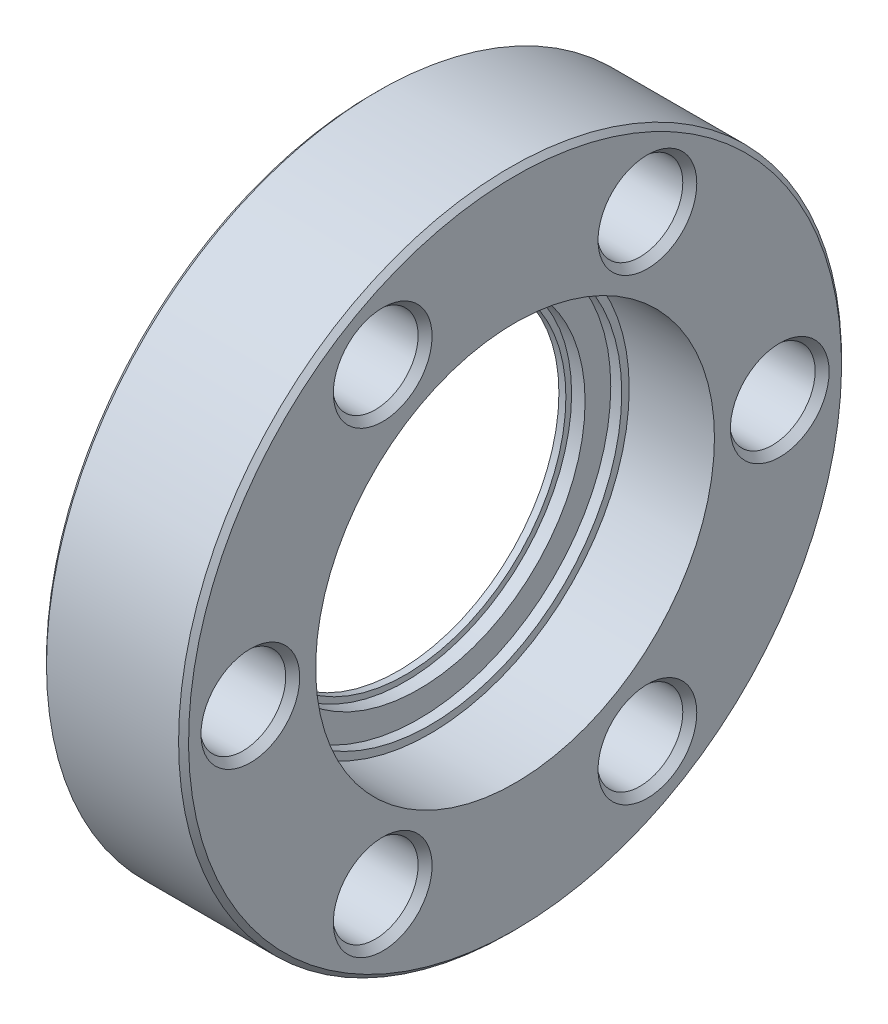
ISO-10303-21;
HEADER;
FILE_DESCRIPTION(('STEP AP214'),'2;1');
FILE_NAME('part.step','',(''),(''),'','','');
FILE_SCHEMA(('AUTOMOTIVE_DESIGN { 1 0 10303 214 1 1 1 1 }'));
ENDSEC;
DATA;
#1=APPLICATION_CONTEXT('core data for automotive mechanical design processes');
#2=APPLICATION_PROTOCOL_DEFINITION('international standard','automotive_design',2000,#1);
#3=PRODUCT_CONTEXT('',#1,'mechanical');
#4=PRODUCT('Part','Part','',(#3));
#5=PRODUCT_RELATED_PRODUCT_CATEGORY('part','',(#4));
#6=PRODUCT_DEFINITION_FORMATION('','',#4);
#7=PRODUCT_DEFINITION_CONTEXT('part definition',#1,'design');
#8=PRODUCT_DEFINITION('design','',#6,#7);
#9=PRODUCT_DEFINITION_SHAPE('','',#8);
#10=(LENGTH_UNIT() NAMED_UNIT(*) SI_UNIT(.MILLI.,.METRE.));
#11=(NAMED_UNIT(*) PLANE_ANGLE_UNIT() SI_UNIT($,.RADIAN.));
#12=(NAMED_UNIT(*) SI_UNIT($,.STERADIAN.) SOLID_ANGLE_UNIT());
#13=UNCERTAINTY_MEASURE_WITH_UNIT(LENGTH_MEASURE(1.E-05),#10,'distance_accuracy_value','');
#14=(GEOMETRIC_REPRESENTATION_CONTEXT(3) GLOBAL_UNCERTAINTY_ASSIGNED_CONTEXT((#13)) GLOBAL_UNIT_ASSIGNED_CONTEXT((#10,
#11,#12)) REPRESENTATION_CONTEXT('',''));
#15=CARTESIAN_POINT('',(0.,0.,0.));
#16=DIRECTION('',(0.,0.,1.));
#17=DIRECTION('',(1.,0.,0.));
#18=AXIS2_PLACEMENT_3D('',#15,#16,#17);
#19=CARTESIAN_POINT('',(1.2954,0.,0.));
#20=DIRECTION('',(1.,0.,0.));
#21=DIRECTION('',(0.,0.,-1.));
#22=AXIS2_PLACEMENT_3D('',#19,#20,#21);
#23=PLANE('',#22);
#24=CARTESIAN_POINT('',(1.2954,0.,0.));
#25=DIRECTION('',(-1.,0.,0.));
#26=DIRECTION('',(0.,0.,1.));
#27=AXIS2_PLACEMENT_3D('',#24,#25,#26);
#28=CIRCLE('',#27,9.144);
#29=CARTESIAN_POINT('',(1.2954,0.,9.144));
#30=VERTEX_POINT('',#29);
#31=EDGE_CURVE('E95',#30,#30,#28,.T.);
#32=ORIENTED_EDGE('',*,*,#31,.T.);
#33=EDGE_LOOP('',(#32));
#34=FACE_BOUND('',#33,.T.);
#35=CARTESIAN_POINT('',(1.2954,0.,0.));
#36=DIRECTION('',(1.,0.,0.));
#37=DIRECTION('',(0.,0.,-1.));
#38=AXIS2_PLACEMENT_3D('',#35,#36,#37);
#39=CIRCLE('',#38,8.1788);
#40=CARTESIAN_POINT('',(1.2954,0.,-8.1788));
#41=VERTEX_POINT('',#40);
#42=EDGE_CURVE('E17',#41,#41,#39,.T.);
#43=ORIENTED_EDGE('',*,*,#42,.T.);
#44=EDGE_LOOP('',(#43));
#45=FACE_BOUND('',#44,.T.);
#46=ADVANCED_FACE('F14',(#34,#45),#23,.F.);
#47=CARTESIAN_POINT('',(0.,0.,0.));
#48=DIRECTION('',(1.,0.,0.));
#49=DIRECTION('',(0.,0.,-1.));
#50=AXIS2_PLACEMENT_3D('',#47,#48,#49);
#51=CYLINDRICAL_SURFACE('',#50,8.1788);
#52=ORIENTED_EDGE('',*,*,#42,.F.);
#53=EDGE_LOOP('',(#52));
#54=FACE_BOUND('',#53,.T.);
#55=CARTESIAN_POINT('',(1.651,0.,0.));
#56=DIRECTION('',(1.,0.,0.));
#57=DIRECTION('',(0.,0.,-1.));
#58=AXIS2_PLACEMENT_3D('',#55,#56,#57);
#59=CIRCLE('',#58,8.1788);
#60=CARTESIAN_POINT('',(1.651,0.,-8.1788));
#61=VERTEX_POINT('',#60);
#62=EDGE_CURVE('E93',#61,#61,#59,.F.);
#63=ORIENTED_EDGE('',*,*,#62,.F.);
#64=EDGE_LOOP('',(#63));
#65=FACE_BOUND('',#64,.T.);
#66=ADVANCED_FACE('F103',(#54,#65),#51,.F.);
#67=CARTESIAN_POINT('',(1.2954,0.,0.));
#68=DIRECTION('',(-1.,0.,0.));
#69=DIRECTION('',(0.,0.,1.));
#70=AXIS2_PLACEMENT_3D('',#67,#68,#69);
#71=CYLINDRICAL_SURFACE('',#70,9.144);
#72=ORIENTED_EDGE('',*,*,#31,.F.);
#73=EDGE_LOOP('',(#72));
#74=FACE_BOUND('',#73,.T.);
#75=CARTESIAN_POINT('',(0.6604,0.,0.));
#76=DIRECTION('',(1.,0.,0.));
#77=DIRECTION('',(0.,0.,-1.));
#78=AXIS2_PLACEMENT_3D('',#75,#76,#77);
#79=CIRCLE('',#78,9.144);
#80=CARTESIAN_POINT('',(0.6604,0.,-9.144));
#81=VERTEX_POINT('',#80);
#82=EDGE_CURVE('E29',#81,#81,#79,.T.);
#83=ORIENTED_EDGE('',*,*,#82,.F.);
#84=EDGE_LOOP('',(#83));
#85=FACE_BOUND('',#84,.T.);
#86=ADVANCED_FACE('F106',(#74,#85),#71,.F.);
#87=CARTESIAN_POINT('',(1.651,0.,0.));
#88=DIRECTION('',(1.,0.,0.));
#89=DIRECTION('',(0.,0.,-1.));
#90=AXIS2_PLACEMENT_3D('',#87,#88,#89);
#91=PLANE('',#90);
#92=ORIENTED_EDGE('',*,*,#62,.T.);
#93=EDGE_LOOP('',(#92));
#94=FACE_BOUND('',#93,.T.);
#95=CARTESIAN_POINT('',(1.651,0.,0.));
#96=DIRECTION('',(1.,0.,0.));
#97=DIRECTION('',(0.,0.,-1.));
#98=AXIS2_PLACEMENT_3D('',#95,#96,#97);
#99=CIRCLE('',#98,8.4709);
#100=CARTESIAN_POINT('',(1.651,0.,-8.4709));
#101=VERTEX_POINT('',#100);
#102=EDGE_CURVE('E90',#101,#101,#99,.T.);
#103=ORIENTED_EDGE('',*,*,#102,.T.);
#104=EDGE_LOOP('',(#103));
#105=FACE_BOUND('',#104,.T.);
#106=ADVANCED_FACE('F109',(#94,#105),#91,.T.);
#107=CARTESIAN_POINT('',(1.2335803249224,0.,0.));
#108=DIRECTION('',(1.,0.,0.));
#109=DIRECTION('',(0.,0.,-1.));
#110=AXIS2_PLACEMENT_3D('',#107,#108,#109);
#111=CONICAL_SURFACE('',#110,10.7188,1.22173047639604);
#112=CARTESIAN_POINT('',(1.2335803249224,0.,0.));
#113=DIRECTION('',(1.,0.,0.));
#114=DIRECTION('',(0.,0.,-1.));
#115=AXIS2_PLACEMENT_3D('',#112,#113,#114);
#116=CIRCLE('',#115,10.7188);
#117=CARTESIAN_POINT('',(1.2335803249224,0.,-10.7188));
#118=VERTEX_POINT('',#117);
#119=EDGE_CURVE('E89',#118,#118,#116,.F.);
#120=ORIENTED_EDGE('',*,*,#119,.T.);
#121=EDGE_LOOP('',(#120));
#122=FACE_BOUND('',#121,.T.);
#123=ORIENTED_EDGE('',*,*,#82,.T.);
#124=EDGE_LOOP('',(#123));
#125=FACE_BOUND('',#124,.T.);
#126=ADVANCED_FACE('F112',(#122,#125),#111,.T.);
#127=CARTESIAN_POINT('',(1.651,0.,0.));
#128=DIRECTION('',(1.,0.,0.));
#129=DIRECTION('',(0.,0.,-1.));
#130=AXIS2_PLACEMENT_3D('',#127,#128,#129);
#131=CYLINDRICAL_SURFACE('',#130,8.4709);
#132=ORIENTED_EDGE('',*,*,#102,.F.);
#133=EDGE_LOOP('',(#132));
#134=FACE_BOUND('',#133,.T.);
#135=CARTESIAN_POINT('',(2.3368,0.,0.));
#136=DIRECTION('',(1.,0.,0.));
#137=DIRECTION('',(0.,0.,-1.));
#138=AXIS2_PLACEMENT_3D('',#135,#136,#137);
#139=CIRCLE('',#138,8.4709);
#140=CARTESIAN_POINT('',(2.3368,0.,-8.4709));
#141=VERTEX_POINT('',#140);
#142=EDGE_CURVE('E86',#141,#141,#139,.F.);
#143=ORIENTED_EDGE('',*,*,#142,.F.);
#144=EDGE_LOOP('',(#143));
#145=FACE_BOUND('',#144,.T.);
#146=ADVANCED_FACE('F116',(#134,#145),#131,.F.);
#147=CARTESIAN_POINT('',(7.239,0.,0.));
#148=DIRECTION('',(1.,0.,0.));
#149=DIRECTION('',(0.,0.,-1.));
#150=AXIS2_PLACEMENT_3D('',#147,#148,#149);
#151=CYLINDRICAL_SURFACE('',#150,10.7188);
#152=CARTESIAN_POINT('',(0.,0.,0.));
#153=DIRECTION('',(1.,0.,0.));
#154=DIRECTION('',(0.,0.,-1.));
#155=AXIS2_PLACEMENT_3D('',#152,#153,#154);
#156=CIRCLE('',#155,10.7188);
#157=CARTESIAN_POINT('',(0.,0.,-10.7188));
#158=VERTEX_POINT('',#157);
#159=EDGE_CURVE('E83',#158,#158,#156,.F.);
#160=ORIENTED_EDGE('',*,*,#159,.T.);
#161=EDGE_LOOP('',(#160));
#162=FACE_BOUND('',#161,.T.);
#163=ORIENTED_EDGE('',*,*,#119,.F.);
#164=EDGE_LOOP('',(#163));
#165=FACE_BOUND('',#164,.T.);
#166=ADVANCED_FACE('F119',(#162,#165),#151,.F.);
#167=CARTESIAN_POINT('',(2.3368,0.,0.));
#168=DIRECTION('',(1.,0.,0.));
#169=DIRECTION('',(0.,0.,-1.));
#170=AXIS2_PLACEMENT_3D('',#167,#168,#169);
#171=PLANE('',#170);
#172=ORIENTED_EDGE('',*,*,#142,.T.);
#173=EDGE_LOOP('',(#172));
#174=FACE_BOUND('',#173,.T.);
#175=CARTESIAN_POINT('',(2.3368,0.,0.));
#176=DIRECTION('',(1.,0.,0.));
#177=DIRECTION('',(0.,0.,-1.));
#178=AXIS2_PLACEMENT_3D('',#175,#176,#177);
#179=CIRCLE('',#178,9.779);
#180=CARTESIAN_POINT('',(2.3368,0.,-9.779));
#181=VERTEX_POINT('',#180);
#182=EDGE_CURVE('E80',#181,#181,#179,.T.);
#183=ORIENTED_EDGE('',*,*,#182,.T.);
#184=EDGE_LOOP('',(#183));
#185=FACE_BOUND('',#184,.T.);
#186=ADVANCED_FACE('F123',(#174,#185),#171,.T.);
#187=CARTESIAN_POINT('',(0.,0.,0.));
#188=DIRECTION('',(1.,0.,0.));
#189=DIRECTION('',(0.,0.,-1.));
#190=AXIS2_PLACEMENT_3D('',#187,#188,#189);
#191=PLANE('',#190);
#192=ORIENTED_EDGE('',*,*,#159,.F.);
#193=EDGE_LOOP('',(#192));
#194=FACE_BOUND('',#193,.T.);
#195=CARTESIAN_POINT('',(0.,0.,0.));
#196=DIRECTION('',(1.,0.,0.));
#197=DIRECTION('',(0.,0.,-1.));
#198=AXIS2_PLACEMENT_3D('',#195,#196,#197);
#199=CIRCLE('',#198,16.637);
#200=CARTESIAN_POINT('',(0.,0.,-16.637));
#201=VERTEX_POINT('',#200);
#202=EDGE_CURVE('E59',#201,#201,#199,.T.);
#203=ORIENTED_EDGE('',*,*,#202,.F.);
#204=EDGE_LOOP('',(#203));
#205=FACE_BOUND('',#204,.T.);
#206=CARTESIAN_POINT('',(0.,11.6804310310022,-6.74370000000002));
#207=DIRECTION('',(-1.,0.,0.));
#208=DIRECTION('',(0.,0.,1.));
#209=AXIS2_PLACEMENT_3D('',#206,#207,#208);
#210=CIRCLE('',#209,2.56540000002181);
#211=CARTESIAN_POINT('',(0.,11.6804310310022,-4.17829999997821));
#212=VERTEX_POINT('',#211);
#213=EDGE_CURVE('E62',#212,#212,#210,.F.);
#214=ORIENTED_EDGE('',*,*,#213,.T.);
#215=EDGE_LOOP('',(#214));
#216=FACE_BOUND('',#215,.T.);
#217=CARTESIAN_POINT('',(-5.6843418860808E-11,0.,-13.4874));
#218=DIRECTION('',(-1.,0.,0.));
#219=DIRECTION('',(0.,0.,1.));
#220=AXIS2_PLACEMENT_3D('',#217,#218,#219);
#221=CIRCLE('',#220,2.56540000004833);
#222=CARTESIAN_POINT('',(-5.6843418860808E-11,0.,-10.9219999999517));
#223=VERTEX_POINT('',#222);
#224=EDGE_CURVE('E65',#223,#223,#221,.F.);
#225=ORIENTED_EDGE('',*,*,#224,.T.);
#226=EDGE_LOOP('',(#225));
#227=FACE_BOUND('',#226,.T.);
#228=CARTESIAN_POINT('',(0.,-11.6804310310023,-6.74369999999993));
#229=DIRECTION('',(-1.,0.,0.));
#230=DIRECTION('',(0.,0.,1.));
#231=AXIS2_PLACEMENT_3D('',#228,#229,#230);
#232=CIRCLE('',#231,2.56539999996488);
#233=CARTESIAN_POINT('',(0.,-11.6804310310023,-4.17830000003505));
#234=VERTEX_POINT('',#233);
#235=EDGE_CURVE('E68',#234,#234,#232,.F.);
#236=ORIENTED_EDGE('',*,*,#235,.T.);
#237=EDGE_LOOP('',(#236));
#238=FACE_BOUND('',#237,.T.);
#239=CARTESIAN_POINT('',(0.,-11.6804310310022,6.7437000000001));
#240=DIRECTION('',(-1.,0.,0.));
#241=DIRECTION('',(0.,0.,1.));
#242=AXIS2_PLACEMENT_3D('',#239,#240,#241);
#243=CIRCLE('',#242,2.56539999999575);
#244=CARTESIAN_POINT('',(0.,-11.6804310310022,9.30909999999585));
#245=VERTEX_POINT('',#244);
#246=EDGE_CURVE('E71',#245,#245,#243,.F.);
#247=ORIENTED_EDGE('',*,*,#246,.T.);
#248=EDGE_LOOP('',(#247));
#249=FACE_BOUND('',#248,.T.);
#250=CARTESIAN_POINT('',(-5.6843418860808E-11,1.43982048506075E-13,13.4874));
#251=DIRECTION('',(-1.,0.,0.));
#252=DIRECTION('',(0.,0.,1.));
#253=AXIS2_PLACEMENT_3D('',#250,#251,#252);
#254=CIRCLE('',#253,2.5654000000113);
#255=CARTESIAN_POINT('',(-5.6843418860808E-11,1.43982048506075E-13,16.0528000000113));
#256=VERTEX_POINT('',#255);
#257=EDGE_CURVE('E74',#256,#256,#254,.F.);
#258=ORIENTED_EDGE('',*,*,#257,.T.);
#259=EDGE_LOOP('',(#258));
#260=FACE_BOUND('',#259,.T.);
#261=CARTESIAN_POINT('',(5.6843418860808E-11,11.6804310310023,6.74369999999985));
#262=DIRECTION('',(-1.,0.,0.));
#263=DIRECTION('',(0.,0.,1.));
#264=AXIS2_PLACEMENT_3D('',#261,#262,#263);
#265=CIRCLE('',#264,2.56540000009483);
#266=CARTESIAN_POINT('',(5.6843418860808E-11,11.6804310310023,9.30910000009468));
#267=VERTEX_POINT('',#266);
#268=EDGE_CURVE('E77',#267,#267,#265,.F.);
#269=ORIENTED_EDGE('',*,*,#268,.T.);
#270=EDGE_LOOP('',(#269));
#271=FACE_BOUND('',#270,.T.);
#272=ADVANCED_FACE('F126',(#194,#205,#216,#227,#238,#249,#260,#271),#191,.F.);
#273=CARTESIAN_POINT('',(2.3368,0.,0.));
#274=DIRECTION('',(1.,0.,0.));
#275=DIRECTION('',(0.,0.,-1.));
#276=AXIS2_PLACEMENT_3D('',#273,#274,#275);
#277=CYLINDRICAL_SURFACE('',#276,9.779);
#278=ORIENTED_EDGE('',*,*,#182,.F.);
#279=EDGE_LOOP('',(#278));
#280=FACE_BOUND('',#279,.T.);
#281=CARTESIAN_POINT('',(2.8956,0.,0.));
#282=DIRECTION('',(1.,0.,0.));
#283=DIRECTION('',(0.,0.,-1.));
#284=AXIS2_PLACEMENT_3D('',#281,#282,#283);
#285=CIRCLE('',#284,9.779);
#286=CARTESIAN_POINT('',(2.8956,0.,-9.779));
#287=VERTEX_POINT('',#286);
#288=EDGE_CURVE('E55',#287,#287,#285,.F.);
#289=ORIENTED_EDGE('',*,*,#288,.F.);
#290=EDGE_LOOP('',(#289));
#291=FACE_BOUND('',#290,.T.);
#292=ADVANCED_FACE('F130',(#280,#291),#277,.F.);
#293=CARTESIAN_POINT('',(1.70530256582424E-10,11.6804310310023,6.74369999999985));
#294=DIRECTION('',(-1.,0.,0.));
#295=DIRECTION('',(0.,0.,1.));
#296=AXIS2_PLACEMENT_3D('',#293,#294,#295);
#297=CONICAL_SURFACE('',#296,2.565399999996,0.715584993335024);
#298=CARTESIAN_POINT('',(0.438290363151198,11.6804310310023,6.74369999999985));
#299=DIRECTION('',(-1.,0.,0.));
#300=DIRECTION('',(0.,0.,1.));
#301=AXIS2_PLACEMENT_3D('',#298,#299,#300);
#302=CIRCLE('',#301,2.1844);
#303=CARTESIAN_POINT('',(0.438290363151198,11.6804310310023,8.92809999999985));
#304=VERTEX_POINT('',#303);
#305=EDGE_CURVE('E58',#304,#304,#302,.F.);
#306=ORIENTED_EDGE('',*,*,#305,.T.);
#307=EDGE_LOOP('',(#306));
#308=FACE_BOUND('',#307,.T.);
#309=ORIENTED_EDGE('',*,*,#268,.F.);
#310=EDGE_LOOP('',(#309));
#311=FACE_BOUND('',#310,.T.);
#312=ADVANCED_FACE('F133',(#308,#311),#297,.F.);
#313=CARTESIAN_POINT('',(-5.6843418860808E-11,1.43982048506075E-13,13.4874));
#314=DIRECTION('',(-1.,0.,0.));
#315=DIRECTION('',(0.,0.,1.));
#316=AXIS2_PLACEMENT_3D('',#313,#314,#315);
#317=CONICAL_SURFACE('',#316,2.5654000000113,0.715584993325368);
#318=CARTESIAN_POINT('',(0.438290363151205,1.43982048506075E-13,13.4874));
#319=DIRECTION('',(-1.,0.,0.));
#320=DIRECTION('',(0.,0.,1.));
#321=AXIS2_PLACEMENT_3D('',#318,#319,#320);
#322=CIRCLE('',#321,2.1844);
#323=CARTESIAN_POINT('',(0.438290363151205,1.43982048506075E-13,15.6718));
#324=VERTEX_POINT('',#323);
#325=EDGE_CURVE('E228',#324,#324,#322,.F.);
#326=ORIENTED_EDGE('',*,*,#325,.T.);
#327=EDGE_LOOP('',(#326));
#328=FACE_BOUND('',#327,.T.);
#329=ORIENTED_EDGE('',*,*,#257,.F.);
#330=EDGE_LOOP('',(#329));
#331=FACE_BOUND('',#330,.T.);
#332=ADVANCED_FACE('F306',(#328,#331),#317,.F.);
#333=CARTESIAN_POINT('',(0.,-11.6804310310022,6.7437000000001));
#334=DIRECTION('',(-1.,0.,0.));
#335=DIRECTION('',(0.,0.,1.));
#336=AXIS2_PLACEMENT_3D('',#333,#334,#335);
#337=CONICAL_SURFACE('',#336,2.56539999999575,0.715584993335024);
#338=CARTESIAN_POINT('',(0.438290363151198,-11.6804310310022,6.7437000000001));
#339=DIRECTION('',(-1.,0.,0.));
#340=DIRECTION('',(0.,0.,1.));
#341=AXIS2_PLACEMENT_3D('',#338,#339,#340);
#342=CIRCLE('',#341,2.1844);
#343=CARTESIAN_POINT('',(0.438290363151198,-11.6804310310022,8.9281000000001));
#344=VERTEX_POINT('',#343);
#345=EDGE_CURVE('E225',#344,#344,#342,.F.);
#346=ORIENTED_EDGE('',*,*,#345,.T.);
#347=EDGE_LOOP('',(#346));
#348=FACE_BOUND('',#347,.T.);
#349=ORIENTED_EDGE('',*,*,#246,.F.);
#350=EDGE_LOOP('',(#349));
#351=FACE_BOUND('',#350,.T.);
#352=ADVANCED_FACE('F316',(#348,#351),#337,.F.);
#353=CARTESIAN_POINT('',(0.,-11.6804310310023,-6.74369999999993));
#354=DIRECTION('',(-1.,0.,0.));
#355=DIRECTION('',(0.,0.,1.));
#356=AXIS2_PLACEMENT_3D('',#353,#354,#355);
#357=CONICAL_SURFACE('',#356,2.56539999996488,0.715584993325368);
#358=CARTESIAN_POINT('',(0.438290363151204,-11.6804310310023,-6.74369999999993));
#359=DIRECTION('',(-1.,0.,0.));
#360=DIRECTION('',(0.,0.,1.));
#361=AXIS2_PLACEMENT_3D('',#358,#359,#360);
#362=CIRCLE('',#361,2.1844);
#363=CARTESIAN_POINT('',(0.438290363151204,-11.6804310310023,-4.55929999999993));
#364=VERTEX_POINT('',#363);
#365=EDGE_CURVE('E222',#364,#364,#362,.F.);
#366=ORIENTED_EDGE('',*,*,#365,.T.);
#367=EDGE_LOOP('',(#366));
#368=FACE_BOUND('',#367,.T.);
#369=ORIENTED_EDGE('',*,*,#235,.F.);
#370=EDGE_LOOP('',(#369));
#371=FACE_BOUND('',#370,.T.);
#372=ADVANCED_FACE('F326',(#368,#371),#357,.F.);
#373=CARTESIAN_POINT('',(5.6843418860808E-11,0.,-13.4874));
#374=DIRECTION('',(-1.,0.,0.));
#375=DIRECTION('',(0.,0.,1.));
#376=AXIS2_PLACEMENT_3D('',#373,#374,#375);
#377=CONICAL_SURFACE('',#376,2.5653999999495,0.715584993335024);
#378=CARTESIAN_POINT('',(0.438290363151191,0.,-13.4874));
#379=DIRECTION('',(-1.,0.,0.));
#380=DIRECTION('',(0.,0.,1.));
#381=AXIS2_PLACEMENT_3D('',#378,#379,#380);
#382=CIRCLE('',#381,2.1844);
#383=CARTESIAN_POINT('',(0.438290363151191,0.,-11.303));
#384=VERTEX_POINT('',#383);
#385=EDGE_CURVE('E219',#384,#384,#382,.F.);
#386=ORIENTED_EDGE('',*,*,#385,.T.);
#387=EDGE_LOOP('',(#386));
#388=FACE_BOUND('',#387,.T.);
#389=ORIENTED_EDGE('',*,*,#224,.F.);
#390=EDGE_LOOP('',(#389));
#391=FACE_BOUND('',#390,.T.);
#392=ADVANCED_FACE('F336',(#388,#391),#377,.F.);
#393=CARTESIAN_POINT('',(0.,11.6804310310022,-6.74370000000002));
#394=DIRECTION('',(-1.,0.,0.));
#395=DIRECTION('',(0.,0.,1.));
#396=AXIS2_PLACEMENT_3D('',#393,#394,#395);
#397=CONICAL_SURFACE('',#396,2.56540000002181,0.715584993335024);
#398=CARTESIAN_POINT('',(0.438290363151198,11.6804310310022,-6.74370000000002));
#399=DIRECTION('',(-1.,0.,0.));
#400=DIRECTION('',(0.,0.,1.));
#401=AXIS2_PLACEMENT_3D('',#398,#399,#400);
#402=CIRCLE('',#401,2.1844);
#403=CARTESIAN_POINT('',(0.438290363151198,11.6804310310022,-4.55930000000002));
#404=VERTEX_POINT('',#403);
#405=EDGE_CURVE('E216',#404,#404,#402,.F.);
#406=ORIENTED_EDGE('',*,*,#405,.T.);
#407=EDGE_LOOP('',(#406));
#408=FACE_BOUND('',#407,.T.);
#409=ORIENTED_EDGE('',*,*,#213,.F.);
#410=EDGE_LOOP('',(#409));
#411=FACE_BOUND('',#410,.T.);
#412=ADVANCED_FACE('F346',(#408,#411),#397,.F.);
#413=CARTESIAN_POINT('',(0.253999999999993,0.,0.));
#414=DIRECTION('',(1.,0.,0.));
#415=DIRECTION('',(0.,0.,-1.));
#416=AXIS2_PLACEMENT_3D('',#413,#414,#415);
#417=CONICAL_SURFACE('',#416,16.891,0.785398163397442);
#418=CARTESIAN_POINT('',(0.253999999999994,0.,0.));
#419=DIRECTION('',(-1.,0.,0.));
#420=DIRECTION('',(0.,0.,1.));
#421=AXIS2_PLACEMENT_3D('',#418,#419,#420);
#422=CIRCLE('',#421,16.891);
#423=CARTESIAN_POINT('',(0.253999999999994,0.,16.891));
#424=VERTEX_POINT('',#423);
#425=EDGE_CURVE('E54',#424,#424,#422,.F.);
#426=ORIENTED_EDGE('',*,*,#425,.F.);
#427=EDGE_LOOP('',(#426));
#428=FACE_BOUND('',#427,.T.);
#429=ORIENTED_EDGE('',*,*,#202,.T.);
#430=EDGE_LOOP('',(#429));
#431=FACE_BOUND('',#430,.T.);
#432=ADVANCED_FACE('F141',(#428,#431),#417,.T.);
#433=CARTESIAN_POINT('',(2.8956,0.,0.));
#434=DIRECTION('',(1.,0.,0.));
#435=DIRECTION('',(0.,0.,-1.));
#436=AXIS2_PLACEMENT_3D('',#433,#434,#435);
#437=PLANE('',#436);
#438=ORIENTED_EDGE('',*,*,#288,.T.);
#439=EDGE_LOOP('',(#438));
#440=FACE_BOUND('',#439,.T.);
#441=CARTESIAN_POINT('',(2.8956,0.,0.));
#442=DIRECTION('',(1.,0.,0.));
#443=DIRECTION('',(0.,0.,-1.));
#444=AXIS2_PLACEMENT_3D('',#441,#442,#443);
#445=CIRCLE('',#444,10.16);
#446=CARTESIAN_POINT('',(2.8956,0.,-10.16));
#447=VERTEX_POINT('',#446);
#448=EDGE_CURVE('E50',#447,#447,#445,.T.);
#449=ORIENTED_EDGE('',*,*,#448,.T.);
#450=EDGE_LOOP('',(#449));
#451=FACE_BOUND('',#450,.T.);
#452=ADVANCED_FACE('F137',(#440,#451),#437,.T.);
#453=CARTESIAN_POINT('',(7.239,11.6804310310023,6.74369999999985));
#454=DIRECTION('',(-1.,0.,0.));
#455=DIRECTION('',(0.,0.,1.));
#456=AXIS2_PLACEMENT_3D('',#453,#454,#455);
#457=CYLINDRICAL_SURFACE('',#456,2.1844);
#458=CARTESIAN_POINT('',(6.85800000002246,11.6804310310023,6.74369999999985));
#459=DIRECTION('',(1.,0.,0.));
#460=DIRECTION('',(0.,0.,-1.));
#461=AXIS2_PLACEMENT_3D('',#458,#459,#460);
#462=CIRCLE('',#461,2.18439999990355);
#463=CARTESIAN_POINT('',(6.85800000002246,11.6804310310023,4.5593000000963));
#464=VERTEX_POINT('',#463);
#465=EDGE_CURVE('E53',#464,#464,#462,.T.);
#466=ORIENTED_EDGE('',*,*,#465,.T.);
#467=EDGE_LOOP('',(#466));
#468=FACE_BOUND('',#467,.T.);
#469=ORIENTED_EDGE('',*,*,#305,.F.);
#470=EDGE_LOOP('',(#469));
#471=FACE_BOUND('',#470,.T.);
#472=ADVANCED_FACE('F140',(#468,#471),#457,.F.);
#473=CARTESIAN_POINT('',(7.239,1.43982048506075E-13,13.4874));
#474=DIRECTION('',(-1.,0.,0.));
#475=DIRECTION('',(0.,0.,1.));
#476=AXIS2_PLACEMENT_3D('',#473,#474,#475);
#477=CYLINDRICAL_SURFACE('',#476,2.1844);
#478=CARTESIAN_POINT('',(6.85800000002246,1.43982048506075E-13,13.4874));
#479=DIRECTION('',(1.,0.,0.));
#480=DIRECTION('',(0.,0.,-1.));
#481=AXIS2_PLACEMENT_3D('',#478,#479,#480);
#482=CIRCLE('',#481,2.18440000000194);
#483=CARTESIAN_POINT('',(6.85800000002246,1.43982048506075E-13,11.3029999999981));
#484=VERTEX_POINT('',#483);
#485=EDGE_CURVE('E197',#484,#484,#482,.T.);
#486=ORIENTED_EDGE('',*,*,#485,.T.);
#487=EDGE_LOOP('',(#486));
#488=FACE_BOUND('',#487,.T.);
#489=ORIENTED_EDGE('',*,*,#325,.F.);
#490=EDGE_LOOP('',(#489));
#491=FACE_BOUND('',#490,.T.);
#492=ADVANCED_FACE('F380',(#488,#491),#477,.F.);
#493=CARTESIAN_POINT('',(7.239,-11.6804310310022,6.7437000000001));
#494=DIRECTION('',(-1.,0.,0.));
#495=DIRECTION('',(0.,0.,1.));
#496=AXIS2_PLACEMENT_3D('',#493,#494,#495);
#497=CYLINDRICAL_SURFACE('',#496,2.1844);
#498=CARTESIAN_POINT('',(6.85800000002246,-11.6804310310022,6.7437000000001));
#499=DIRECTION('',(1.,0.,0.));
#500=DIRECTION('',(0.,0.,-1.));
#501=AXIS2_PLACEMENT_3D('',#498,#499,#500);
#502=CIRCLE('',#501,2.18440000001749);
#503=CARTESIAN_POINT('',(6.85800000002246,-11.6804310310022,4.55929999998261));
#504=VERTEX_POINT('',#503);
#505=EDGE_CURVE('E205',#504,#504,#502,.T.);
#506=ORIENTED_EDGE('',*,*,#505,.T.);
#507=EDGE_LOOP('',(#506));
#508=FACE_BOUND('',#507,.T.);
#509=ORIENTED_EDGE('',*,*,#345,.F.);
#510=EDGE_LOOP('',(#509));
#511=FACE_BOUND('',#510,.T.);
#512=ADVANCED_FACE('F390',(#508,#511),#497,.F.);
#513=CARTESIAN_POINT('',(7.239,-11.6804310310023,-6.74369999999993));
#514=DIRECTION('',(-1.,0.,0.));
#515=DIRECTION('',(0.,0.,1.));
#516=AXIS2_PLACEMENT_3D('',#513,#514,#515);
#517=CYLINDRICAL_SURFACE('',#516,2.1844);
#518=CARTESIAN_POINT('',(6.85799999996561,-11.6804310310023,-6.74369999999993));
#519=DIRECTION('',(1.,0.,0.));
#520=DIRECTION('',(0.,0.,-1.));
#521=AXIS2_PLACEMENT_3D('',#518,#519,#520);
#522=CIRCLE('',#521,2.18440000004836);
#523=CARTESIAN_POINT('',(6.85799999996561,-11.6804310310023,-8.92810000004829));
#524=VERTEX_POINT('',#523);
#525=EDGE_CURVE('E208',#524,#524,#522,.T.);
#526=ORIENTED_EDGE('',*,*,#525,.T.);
#527=EDGE_LOOP('',(#526));
#528=FACE_BOUND('',#527,.T.);
#529=ORIENTED_EDGE('',*,*,#365,.F.);
#530=EDGE_LOOP('',(#529));
#531=FACE_BOUND('',#530,.T.);
#532=ADVANCED_FACE('F399',(#528,#531),#517,.F.);
#533=CARTESIAN_POINT('',(7.239,0.,-13.4874));
#534=DIRECTION('',(-1.,0.,0.));
#535=DIRECTION('',(0.,0.,1.));
#536=AXIS2_PLACEMENT_3D('',#533,#534,#535);
#537=CYLINDRICAL_SURFACE('',#536,2.1844);
#538=CARTESIAN_POINT('',(6.85799999996561,0.,-13.4874));
#539=DIRECTION('',(1.,0.,0.));
#540=DIRECTION('',(0.,0.,-1.));
#541=AXIS2_PLACEMENT_3D('',#538,#539,#540);
#542=CIRCLE('',#541,2.18439999995005);
#543=CARTESIAN_POINT('',(6.85799999996561,0.,-15.6717999999501));
#544=VERTEX_POINT('',#543);
#545=EDGE_CURVE('E511',#544,#544,#542,.T.);
#546=ORIENTED_EDGE('',*,*,#545,.T.);
#547=EDGE_LOOP('',(#546));
#548=FACE_BOUND('',#547,.T.);
#549=ORIENTED_EDGE('',*,*,#385,.F.);
#550=EDGE_LOOP('',(#549));
#551=FACE_BOUND('',#550,.T.);
#552=ADVANCED_FACE('F409',(#548,#551),#537,.F.);
#553=CARTESIAN_POINT('',(7.239,11.6804310310022,-6.74370000000002));
#554=DIRECTION('',(-1.,0.,0.));
#555=DIRECTION('',(0.,0.,1.));
#556=AXIS2_PLACEMENT_3D('',#553,#554,#555);
#557=CYLINDRICAL_SURFACE('',#556,2.1844);
#558=CARTESIAN_POINT('',(6.85800000002246,11.6804310310022,-6.74370000000002));
#559=DIRECTION('',(1.,0.,0.));
#560=DIRECTION('',(0.,0.,-1.));
#561=AXIS2_PLACEMENT_3D('',#558,#559,#560);
#562=CIRCLE('',#561,2.18440000004827);
#563=CARTESIAN_POINT('',(6.85800000002246,11.6804310310022,-8.92810000004829));
#564=VERTEX_POINT('',#563);
#565=EDGE_CURVE('E491',#564,#564,#562,.T.);
#566=ORIENTED_EDGE('',*,*,#565,.T.);
#567=EDGE_LOOP('',(#566));
#568=FACE_BOUND('',#567,.T.);
#569=ORIENTED_EDGE('',*,*,#405,.F.);
#570=EDGE_LOOP('',(#569));
#571=FACE_BOUND('',#570,.T.);
#572=ADVANCED_FACE('F159',(#568,#571),#557,.F.);
#573=CARTESIAN_POINT('',(7.239,0.,0.));
#574=DIRECTION('',(-1.,0.,0.));
#575=DIRECTION('',(0.,0.,1.));
#576=AXIS2_PLACEMENT_3D('',#573,#574,#575);
#577=CYLINDRICAL_SURFACE('',#576,16.891);
#578=ORIENTED_EDGE('',*,*,#425,.T.);
#579=EDGE_LOOP('',(#578));
#580=FACE_BOUND('',#579,.T.);
#581=CARTESIAN_POINT('',(6.98500000000001,0.,0.));
#582=DIRECTION('',(-1.,0.,0.));
#583=DIRECTION('',(0.,0.,1.));
#584=AXIS2_PLACEMENT_3D('',#581,#582,#583);
#585=CIRCLE('',#584,16.891);
#586=CARTESIAN_POINT('',(6.98500000000001,0.,16.891));
#587=VERTEX_POINT('',#586);
#588=EDGE_CURVE('E49',#587,#587,#585,.F.);
#589=ORIENTED_EDGE('',*,*,#588,.F.);
#590=EDGE_LOOP('',(#589));
#591=FACE_BOUND('',#590,.T.);
#592=ADVANCED_FACE('F148',(#580,#591),#577,.T.);
#593=CARTESIAN_POINT('',(2.8956,0.,0.));
#594=DIRECTION('',(1.,0.,0.));
#595=DIRECTION('',(0.,0.,-1.));
#596=AXIS2_PLACEMENT_3D('',#593,#594,#595);
#597=CYLINDRICAL_SURFACE('',#596,10.16);
#598=CARTESIAN_POINT('',(7.239,0.,0.));
#599=DIRECTION('',(1.,0.,0.));
#600=DIRECTION('',(0.,0.,-1.));
#601=AXIS2_PLACEMENT_3D('',#598,#599,#600);
#602=CIRCLE('',#601,10.16);
#603=CARTESIAN_POINT('',(7.239,0.,-10.16));
#604=VERTEX_POINT('',#603);
#605=EDGE_CURVE('E46',#604,#604,#602,.F.);
#606=ORIENTED_EDGE('',*,*,#605,.F.);
#607=EDGE_LOOP('',(#606));
#608=FACE_BOUND('',#607,.T.);
#609=ORIENTED_EDGE('',*,*,#448,.F.);
#610=EDGE_LOOP('',(#609));
#611=FACE_BOUND('',#610,.T.);
#612=ADVANCED_FACE('F145',(#608,#611),#597,.F.);
#613=CARTESIAN_POINT('',(7.23900000002686,11.6804310310023,6.74369999999985));
#614=DIRECTION('',(1.,0.,0.));
#615=DIRECTION('',(0.,1.,0.));
#616=AXIS2_PLACEMENT_3D('',#613,#614,#615);
#617=CONICAL_SURFACE('',#616,2.51559824708497,0.715584993421736);
#618=ORIENTED_EDGE('',*,*,#465,.F.);
#619=EDGE_LOOP('',(#618));
#620=FACE_BOUND('',#619,.T.);
#621=CARTESIAN_POINT('',(7.23900000002686,11.6804310310023,6.74369999999985));
#622=DIRECTION('',(1.,0.,0.));
#623=DIRECTION('',(0.,1.,0.));
#624=AXIS2_PLACEMENT_3D('',#621,#622,#623);
#625=CIRCLE('',#624,2.51559824708497);
#626=CARTESIAN_POINT('',(7.23900000002686,14.1960292780873,6.74369999999985));
#627=VERTEX_POINT('',#626);
#628=EDGE_CURVE('E43',#627,#627,#625,.F.);
#629=ORIENTED_EDGE('',*,*,#628,.F.);
#630=EDGE_LOOP('',(#629));
#631=FACE_BOUND('',#630,.T.);
#632=ADVANCED_FACE('F147',(#620,#631),#617,.F.);
#633=CARTESIAN_POINT('',(7.23900000002686,1.43982048506075E-13,13.4874));
#634=DIRECTION('',(1.,0.,0.));
#635=DIRECTION('',(0.,1.,0.));
#636=AXIS2_PLACEMENT_3D('',#633,#634,#635);
#637=CONICAL_SURFACE('',#636,2.51559824712651,0.715584993358972);
#638=ORIENTED_EDGE('',*,*,#485,.F.);
#639=EDGE_LOOP('',(#638));
#640=FACE_BOUND('',#639,.T.);
#641=CARTESIAN_POINT('',(7.23900000002686,1.43982048506075E-13,13.4874));
#642=DIRECTION('',(1.,0.,0.));
#643=DIRECTION('',(0.,1.,0.));
#644=AXIS2_PLACEMENT_3D('',#641,#642,#643);
#645=CIRCLE('',#644,2.51559824712651);
#646=CARTESIAN_POINT('',(7.23900000002686,2.51559824712666,13.4874));
#647=VERTEX_POINT('',#646);
#648=EDGE_CURVE('E40',#647,#647,#645,.F.);
#649=ORIENTED_EDGE('',*,*,#648,.F.);
#650=EDGE_LOOP('',(#649));
#651=FACE_BOUND('',#650,.T.);
#652=ADVANCED_FACE('F156',(#640,#651),#637,.F.);
#653=CARTESIAN_POINT('',(7.23899999997002,-11.6804310310022,6.7437000000001));
#654=DIRECTION('',(1.,0.,0.));
#655=DIRECTION('',(0.,0.,-1.));
#656=AXIS2_PLACEMENT_3D('',#653,#654,#655);
#657=CONICAL_SURFACE('',#656,2.51559824708522,0.715584993325648);
#658=ORIENTED_EDGE('',*,*,#505,.F.);
#659=EDGE_LOOP('',(#658));
#660=FACE_BOUND('',#659,.T.);
#661=CARTESIAN_POINT('',(7.23899999997002,-11.6804310310022,6.7437000000001));
#662=DIRECTION('',(1.,0.,0.));
#663=DIRECTION('',(0.,0.,-1.));
#664=AXIS2_PLACEMENT_3D('',#661,#662,#663);
#665=CIRCLE('',#664,2.51559824708522);
#666=CARTESIAN_POINT('',(7.23899999997002,-11.6804310310022,4.22810175291488));
#667=VERTEX_POINT('',#666);
#668=EDGE_CURVE('E37',#667,#667,#665,.F.);
#669=ORIENTED_EDGE('',*,*,#668,.F.);
#670=EDGE_LOOP('',(#669));
#671=FACE_BOUND('',#670,.T.);
#672=ADVANCED_FACE('F185',(#660,#671),#657,.F.);
#673=CARTESIAN_POINT('',(7.23899999979949,-11.6804310310023,-6.74369999999993));
#674=DIRECTION('',(1.,0.,0.));
#675=DIRECTION('',(0.,0.,-1.));
#676=AXIS2_PLACEMENT_3D('',#673,#674,#675);
#677=CONICAL_SURFACE('',#676,2.5155982470024,0.715584993336756);
#678=ORIENTED_EDGE('',*,*,#525,.F.);
#679=EDGE_LOOP('',(#678));
#680=FACE_BOUND('',#679,.T.);
#681=CARTESIAN_POINT('',(7.23899999997002,-11.6804310310023,-6.74369999999993));
#682=DIRECTION('',(1.,0.,0.));
#683=DIRECTION('',(0.,0.,-1.));
#684=AXIS2_PLACEMENT_3D('',#681,#682,#683);
#685=CIRCLE('',#684,2.51559824715064);
#686=CARTESIAN_POINT('',(7.23899999997002,-11.6804310310023,-9.25929824715057));
#687=VERTEX_POINT('',#686);
#688=EDGE_CURVE('E34',#687,#687,#685,.F.);
#689=ORIENTED_EDGE('',*,*,#688,.F.);
#690=EDGE_LOOP('',(#689));
#691=FACE_BOUND('',#690,.T.);
#692=ADVANCED_FACE('F181',(#680,#691),#677,.F.);
#693=CARTESIAN_POINT('',(7.23899999997002,0.,-13.4874));
#694=DIRECTION('',(1.,0.,0.));
#695=DIRECTION('',(0.,0.,-1.));
#696=AXIS2_PLACEMENT_3D('',#693,#694,#695);
#697=CONICAL_SURFACE('',#696,2.51559824707463,0.715584993336756);
#698=ORIENTED_EDGE('',*,*,#545,.F.);
#699=EDGE_LOOP('',(#698));
#700=FACE_BOUND('',#699,.T.);
#701=CARTESIAN_POINT('',(7.23899999997002,0.,-13.4874));
#702=DIRECTION('',(1.,0.,0.));
#703=DIRECTION('',(0.,0.,-1.));
#704=AXIS2_PLACEMENT_3D('',#701,#702,#703);
#705=CIRCLE('',#704,2.51559824707463);
#706=CARTESIAN_POINT('',(7.23899999997002,0.,-16.0029982470746));
#707=VERTEX_POINT('',#706);
#708=EDGE_CURVE('E26',#707,#707,#705,.F.);
#709=ORIENTED_EDGE('',*,*,#708,.F.);
#710=EDGE_LOOP('',(#709));
#711=FACE_BOUND('',#710,.T.);
#712=ADVANCED_FACE('F177',(#700,#711),#697,.F.);
#713=CARTESIAN_POINT('',(7.23899999997002,11.6804310310022,-6.74370000000002));
#714=DIRECTION('',(1.,0.,0.));
#715=DIRECTION('',(0.,0.,-1.));
#716=AXIS2_PLACEMENT_3D('',#713,#714,#715);
#717=CONICAL_SURFACE('',#716,2.515598247116,0.715584993325648);
#718=ORIENTED_EDGE('',*,*,#565,.F.);
#719=EDGE_LOOP('',(#718));
#720=FACE_BOUND('',#719,.T.);
#721=CARTESIAN_POINT('',(7.23899999997002,11.6804310310022,-6.74370000000002));
#722=DIRECTION('',(1.,0.,0.));
#723=DIRECTION('',(0.,0.,-1.));
#724=AXIS2_PLACEMENT_3D('',#721,#722,#723);
#725=CIRCLE('',#724,2.515598247116);
#726=CARTESIAN_POINT('',(7.23899999997002,11.6804310310022,-9.25929824711602));
#727=VERTEX_POINT('',#726);
#728=EDGE_CURVE('E21',#727,#727,#725,.F.);
#729=ORIENTED_EDGE('',*,*,#728,.F.);
#730=EDGE_LOOP('',(#729));
#731=FACE_BOUND('',#730,.T.);
#732=ADVANCED_FACE('F170',(#720,#731),#717,.F.);
#733=CARTESIAN_POINT('',(6.98500000000001,0.,0.));
#734=DIRECTION('',(-1.,0.,0.));
#735=DIRECTION('',(0.,-1.,0.));
#736=AXIS2_PLACEMENT_3D('',#733,#734,#735);
#737=CONICAL_SURFACE('',#736,16.891,0.78539816339746);
#738=ORIENTED_EDGE('',*,*,#588,.T.);
#739=EDGE_LOOP('',(#738));
#740=FACE_BOUND('',#739,.T.);
#741=CARTESIAN_POINT('',(7.239,0.,0.));
#742=DIRECTION('',(-1.,0.,0.));
#743=DIRECTION('',(0.,-1.,0.));
#744=AXIS2_PLACEMENT_3D('',#741,#742,#743);
#745=CIRCLE('',#744,16.637);
#746=CARTESIAN_POINT('',(7.239,-16.637,0.));
#747=VERTEX_POINT('',#746);
#748=EDGE_CURVE('E10',#747,#747,#745,.F.);
#749=ORIENTED_EDGE('',*,*,#748,.F.);
#750=EDGE_LOOP('',(#749));
#751=FACE_BOUND('',#750,.T.);
#752=ADVANCED_FACE('F165',(#740,#751),#737,.T.);
#753=CARTESIAN_POINT('',(7.239,0.,0.));
#754=DIRECTION('',(1.,0.,0.));
#755=DIRECTION('',(0.,0.,-1.));
#756=AXIS2_PLACEMENT_3D('',#753,#754,#755);
#757=PLANE('',#756);
#758=ORIENTED_EDGE('',*,*,#748,.T.);
#759=EDGE_LOOP('',(#758));
#760=FACE_BOUND('',#759,.T.);
#761=ORIENTED_EDGE('',*,*,#728,.T.);
#762=EDGE_LOOP('',(#761));
#763=FACE_BOUND('',#762,.T.);
#764=ORIENTED_EDGE('',*,*,#708,.T.);
#765=EDGE_LOOP('',(#764));
#766=FACE_BOUND('',#765,.T.);
#767=ORIENTED_EDGE('',*,*,#688,.T.);
#768=EDGE_LOOP('',(#767));
#769=FACE_BOUND('',#768,.T.);
#770=ORIENTED_EDGE('',*,*,#668,.T.);
#771=EDGE_LOOP('',(#770));
#772=FACE_BOUND('',#771,.T.);
#773=ORIENTED_EDGE('',*,*,#648,.T.);
#774=EDGE_LOOP('',(#773));
#775=FACE_BOUND('',#774,.T.);
#776=ORIENTED_EDGE('',*,*,#628,.T.);
#777=EDGE_LOOP('',(#776));
#778=FACE_BOUND('',#777,.T.);
#779=ORIENTED_EDGE('',*,*,#605,.T.);
#780=EDGE_LOOP('',(#779));
#781=FACE_BOUND('',#780,.T.);
#782=ADVANCED_FACE('F163',(#760,#763,#766,#769,#772,#775,#778,#781),#757,.T.);
#783=CLOSED_SHELL('',(#46,#66,#86,#106,#126,#146,#166,#186,#272,#292,#312,#332,#352,#372,#392,
#412,#432,#452,#472,#492,#512,#532,#552,#572,#592,#612,#632,#652,#672,#692,#712,#732,#752,#782));
#784=MANIFOLD_SOLID_BREP('B1',#783);
#785=ADVANCED_BREP_SHAPE_REPRESENTATION('',(#18,#784),#14);
#786=SHAPE_DEFINITION_REPRESENTATION(#9,#785);
ENDSEC;
END-ISO-10303-21;
